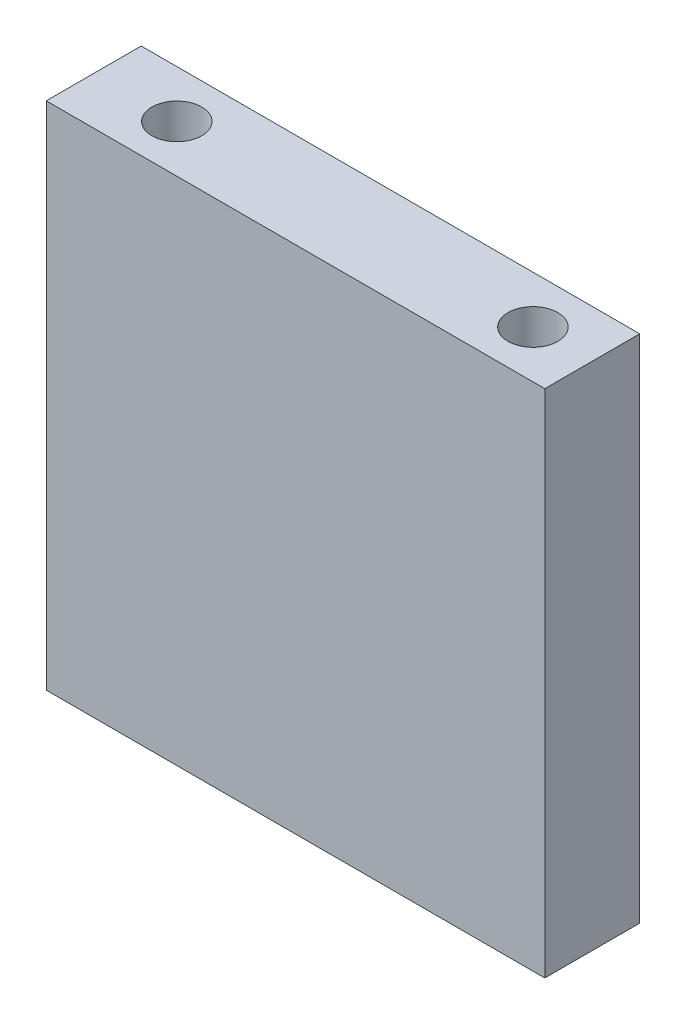
ISO-10303-21;
HEADER;
FILE_DESCRIPTION(('STEP AP214'),'2;1');
FILE_NAME('part.step','',(''),(''),'','','');
FILE_SCHEMA(('AUTOMOTIVE_DESIGN { 1 0 10303 214 1 1 1 1 }'));
ENDSEC;
DATA;
#1=APPLICATION_CONTEXT('core data for automotive mechanical design processes');
#2=APPLICATION_PROTOCOL_DEFINITION('international standard','automotive_design',2000,#1);
#3=PRODUCT_CONTEXT('',#1,'mechanical');
#4=PRODUCT('Part','Part','',(#3));
#5=PRODUCT_RELATED_PRODUCT_CATEGORY('part','',(#4));
#6=PRODUCT_DEFINITION_FORMATION('','',#4);
#7=PRODUCT_DEFINITION_CONTEXT('part definition',#1,'design');
#8=PRODUCT_DEFINITION('design','',#6,#7);
#9=PRODUCT_DEFINITION_SHAPE('','',#8);
#10=(LENGTH_UNIT() NAMED_UNIT(*) SI_UNIT(.MILLI.,.METRE.));
#11=(NAMED_UNIT(*) PLANE_ANGLE_UNIT() SI_UNIT($,.RADIAN.));
#12=(NAMED_UNIT(*) SI_UNIT($,.STERADIAN.) SOLID_ANGLE_UNIT());
#13=UNCERTAINTY_MEASURE_WITH_UNIT(LENGTH_MEASURE(1.E-05),#10,'distance_accuracy_value','');
#14=(GEOMETRIC_REPRESENTATION_CONTEXT(3) GLOBAL_UNCERTAINTY_ASSIGNED_CONTEXT((#13)) GLOBAL_UNIT_ASSIGNED_CONTEXT((#10,
#11,#12)) REPRESENTATION_CONTEXT('',''));
#15=CARTESIAN_POINT('',(0.,0.,0.));
#16=DIRECTION('',(0.,0.,1.));
#17=DIRECTION('',(1.,0.,0.));
#18=AXIS2_PLACEMENT_3D('',#15,#16,#17);
#19=CARTESIAN_POINT('',(0.,0.,8.));
#20=DIRECTION('',(1.,0.,0.));
#21=DIRECTION('',(0.,0.,-1.));
#22=AXIS2_PLACEMENT_3D('',#19,#20,#21);
#23=PLANE('',#22);
#24=DIRECTION('',(0.,-1.,0.));
#25=VECTOR('',#24,1.);
#26=CARTESIAN_POINT('',(0.,0.,0.));
#27=LINE('',#26,#25);
#28=CARTESIAN_POINT('',(0.,43.,0.));
#29=VERTEX_POINT('',#28);
#30=CARTESIAN_POINT('',(0.,0.,0.));
#31=VERTEX_POINT('',#30);
#32=EDGE_CURVE('E96',#29,#31,#27,.T.);
#33=ORIENTED_EDGE('',*,*,#32,.T.);
#34=DIRECTION('',(0.,0.,-1.));
#35=VECTOR('',#34,1.);
#36=CARTESIAN_POINT('',(0.,0.,8.));
#37=LINE('',#36,#35);
#38=CARTESIAN_POINT('',(0.,0.,8.));
#39=VERTEX_POINT('',#38);
#40=EDGE_CURVE('E11',#39,#31,#37,.T.);
#41=ORIENTED_EDGE('',*,*,#40,.F.);
#42=DIRECTION('',(0.,-1.,0.));
#43=VECTOR('',#42,1.);
#44=CARTESIAN_POINT('',(0.,0.,8.));
#45=LINE('',#44,#43);
#46=CARTESIAN_POINT('',(0.,43.,8.));
#47=VERTEX_POINT('',#46);
#48=EDGE_CURVE('E84',#47,#39,#45,.T.);
#49=ORIENTED_EDGE('',*,*,#48,.F.);
#50=DIRECTION('',(0.,0.,-1.));
#51=VECTOR('',#50,1.);
#52=CARTESIAN_POINT('',(0.,43.,8.));
#53=LINE('',#52,#51);
#54=EDGE_CURVE('E92',#47,#29,#53,.T.);
#55=ORIENTED_EDGE('',*,*,#54,.T.);
#56=EDGE_LOOP('',(#33,#41,#49,#55));
#57=FACE_BOUND('',#56,.T.);
#58=ADVANCED_FACE('F33',(#57),#23,.F.);
#59=CARTESIAN_POINT('',(0.,0.,8.));
#60=DIRECTION('',(0.,1.,0.));
#61=DIRECTION('',(0.,0.,1.));
#62=AXIS2_PLACEMENT_3D('',#59,#60,#61);
#63=PLANE('',#62);
#64=CARTESIAN_POINT('',(7.00000000000001,0.,3.99999999999979));
#65=DIRECTION('',(0.,-1.,0.));
#66=DIRECTION('',(0.,0.,-1.));
#67=AXIS2_PLACEMENT_3D('',#64,#65,#66);
#68=CIRCLE('',#67,2.1);
#69=CARTESIAN_POINT('',(7.00000000000001,0.,1.89999999999979));
#70=VERTEX_POINT('',#69);
#71=EDGE_CURVE('E117',#70,#70,#68,.T.);
#72=ORIENTED_EDGE('',*,*,#71,.F.);
#73=EDGE_LOOP('',(#72));
#74=FACE_BOUND('',#73,.T.);
#75=CARTESIAN_POINT('',(37.,0.,4.));
#76=DIRECTION('',(0.,-1.,0.));
#77=DIRECTION('',(0.,0.,-1.));
#78=AXIS2_PLACEMENT_3D('',#75,#76,#77);
#79=CIRCLE('',#78,2.1);
#80=CARTESIAN_POINT('',(37.,0.,1.9));
#81=VERTEX_POINT('',#80);
#82=EDGE_CURVE('E110',#81,#81,#79,.T.);
#83=ORIENTED_EDGE('',*,*,#82,.F.);
#84=EDGE_LOOP('',(#83));
#85=FACE_BOUND('',#84,.T.);
#86=DIRECTION('',(1.,0.,0.));
#87=VECTOR('',#86,1.);
#88=CARTESIAN_POINT('',(0.,0.,0.));
#89=LINE('',#88,#87);
#90=CARTESIAN_POINT('',(42.,0.,0.));
#91=VERTEX_POINT('',#90);
#92=EDGE_CURVE('E88',#31,#91,#89,.T.);
#93=ORIENTED_EDGE('',*,*,#92,.T.);
#94=DIRECTION('',(0.,0.,-1.));
#95=VECTOR('',#94,1.);
#96=CARTESIAN_POINT('',(42.,0.,8.));
#97=LINE('',#96,#95);
#98=CARTESIAN_POINT('',(42.,0.,8.));
#99=VERTEX_POINT('',#98);
#100=EDGE_CURVE('E41',#99,#91,#97,.T.);
#101=ORIENTED_EDGE('',*,*,#100,.F.);
#102=DIRECTION('',(1.,0.,0.));
#103=VECTOR('',#102,1.);
#104=CARTESIAN_POINT('',(0.,0.,8.));
#105=LINE('',#104,#103);
#106=EDGE_CURVE('E79',#39,#99,#105,.T.);
#107=ORIENTED_EDGE('',*,*,#106,.F.);
#108=ORIENTED_EDGE('',*,*,#40,.T.);
#109=EDGE_LOOP('',(#93,#101,#107,#108));
#110=FACE_BOUND('',#109,.T.);
#111=ADVANCED_FACE('F87',(#74,#85,#110),#63,.F.);
#112=CARTESIAN_POINT('',(42.,0.,8.));
#113=DIRECTION('',(-1.,0.,0.));
#114=DIRECTION('',(0.,0.,1.));
#115=AXIS2_PLACEMENT_3D('',#112,#113,#114);
#116=PLANE('',#115);
#117=DIRECTION('',(0.,1.,0.));
#118=VECTOR('',#117,1.);
#119=CARTESIAN_POINT('',(42.,0.,0.));
#120=LINE('',#119,#118);
#121=CARTESIAN_POINT('',(42.,43.,0.));
#122=VERTEX_POINT('',#121);
#123=EDGE_CURVE('E66',#91,#122,#120,.T.);
#124=ORIENTED_EDGE('',*,*,#123,.T.);
#125=DIRECTION('',(0.,0.,-1.));
#126=VECTOR('',#125,1.);
#127=CARTESIAN_POINT('',(42.,43.,8.));
#128=LINE('',#127,#126);
#129=CARTESIAN_POINT('',(42.,43.,8.));
#130=VERTEX_POINT('',#129);
#131=EDGE_CURVE('E89',#130,#122,#128,.T.);
#132=ORIENTED_EDGE('',*,*,#131,.F.);
#133=DIRECTION('',(0.,1.,0.));
#134=VECTOR('',#133,1.);
#135=CARTESIAN_POINT('',(42.,0.,8.));
#136=LINE('',#135,#134);
#137=EDGE_CURVE('E82',#99,#130,#136,.T.);
#138=ORIENTED_EDGE('',*,*,#137,.F.);
#139=ORIENTED_EDGE('',*,*,#100,.T.);
#140=EDGE_LOOP('',(#124,#132,#138,#139));
#141=FACE_BOUND('',#140,.T.);
#142=ADVANCED_FACE('F90',(#141),#116,.F.);
#143=CARTESIAN_POINT('',(0.,43.,8.));
#144=DIRECTION('',(0.,-1.,0.));
#145=DIRECTION('',(0.,0.,-1.));
#146=AXIS2_PLACEMENT_3D('',#143,#144,#145);
#147=PLANE('',#146);
#148=CARTESIAN_POINT('',(37.,43.,4.));
#149=DIRECTION('',(0.,1.,0.));
#150=DIRECTION('',(0.,0.,1.));
#151=AXIS2_PLACEMENT_3D('',#148,#149,#150);
#152=CIRCLE('',#151,2.1);
#153=CARTESIAN_POINT('',(37.,43.,6.1));
#154=VERTEX_POINT('',#153);
#155=EDGE_CURVE('E128',#154,#154,#152,.T.);
#156=ORIENTED_EDGE('',*,*,#155,.F.);
#157=EDGE_LOOP('',(#156));
#158=FACE_BOUND('',#157,.T.);
#159=CARTESIAN_POINT('',(7.00000000000001,43.,4.00000000000021));
#160=DIRECTION('',(0.,1.,0.));
#161=DIRECTION('',(0.,0.,1.));
#162=AXIS2_PLACEMENT_3D('',#159,#160,#161);
#163=CIRCLE('',#162,2.1);
#164=CARTESIAN_POINT('',(7.00000000000001,43.,6.10000000000021));
#165=VERTEX_POINT('',#164);
#166=EDGE_CURVE('E122',#165,#165,#163,.T.);
#167=ORIENTED_EDGE('',*,*,#166,.F.);
#168=EDGE_LOOP('',(#167));
#169=FACE_BOUND('',#168,.T.);
#170=DIRECTION('',(-1.,0.,0.));
#171=VECTOR('',#170,1.);
#172=CARTESIAN_POINT('',(0.,43.,0.));
#173=LINE('',#172,#171);
#174=EDGE_CURVE('E72',#122,#29,#173,.T.);
#175=ORIENTED_EDGE('',*,*,#174,.T.);
#176=ORIENTED_EDGE('',*,*,#54,.F.);
#177=DIRECTION('',(-1.,0.,0.));
#178=VECTOR('',#177,1.);
#179=CARTESIAN_POINT('',(0.,43.,8.));
#180=LINE('',#179,#178);
#181=EDGE_CURVE('E49',#130,#47,#180,.T.);
#182=ORIENTED_EDGE('',*,*,#181,.F.);
#183=ORIENTED_EDGE('',*,*,#131,.T.);
#184=EDGE_LOOP('',(#175,#176,#182,#183));
#185=FACE_BOUND('',#184,.T.);
#186=ADVANCED_FACE('F104',(#158,#169,#185),#147,.F.);
#187=CARTESIAN_POINT('',(0.,0.,8.));
#188=DIRECTION('',(0.,0.,-1.));
#189=DIRECTION('',(-1.,0.,0.));
#190=AXIS2_PLACEMENT_3D('',#187,#188,#189);
#191=PLANE('',#190);
#192=ORIENTED_EDGE('',*,*,#48,.T.);
#193=ORIENTED_EDGE('',*,*,#106,.T.);
#194=ORIENTED_EDGE('',*,*,#137,.T.);
#195=ORIENTED_EDGE('',*,*,#181,.T.);
#196=EDGE_LOOP('',(#192,#193,#194,#195));
#197=FACE_BOUND('',#196,.T.);
#198=ADVANCED_FACE('F80',(#197),#191,.F.);
#199=CARTESIAN_POINT('',(0.,0.,0.));
#200=DIRECTION('',(0.,0.,-1.));
#201=DIRECTION('',(-1.,0.,0.));
#202=AXIS2_PLACEMENT_3D('',#199,#200,#201);
#203=PLANE('',#202);
#204=ORIENTED_EDGE('',*,*,#32,.F.);
#205=ORIENTED_EDGE('',*,*,#174,.F.);
#206=ORIENTED_EDGE('',*,*,#123,.F.);
#207=ORIENTED_EDGE('',*,*,#92,.F.);
#208=EDGE_LOOP('',(#204,#205,#206,#207));
#209=FACE_BOUND('',#208,.T.);
#210=ADVANCED_FACE('F107',(#209),#203,.T.);
#211=CARTESIAN_POINT('',(37.,10.,4.));
#212=DIRECTION('',(0.,-1.,0.));
#213=DIRECTION('',(0.,0.,-1.));
#214=AXIS2_PLACEMENT_3D('',#211,#212,#213);
#215=CYLINDRICAL_SURFACE('',#214,2.1);
#216=CARTESIAN_POINT('',(37.,10.,4.));
#217=DIRECTION('',(0.,-1.,0.));
#218=DIRECTION('',(0.,0.,-1.));
#219=AXIS2_PLACEMENT_3D('',#216,#217,#218);
#220=CIRCLE('',#219,2.1);
#221=CARTESIAN_POINT('',(37.,10.,1.9));
#222=VERTEX_POINT('',#221);
#223=EDGE_CURVE('E113',#222,#222,#220,.T.);
#224=ORIENTED_EDGE('',*,*,#223,.F.);
#225=EDGE_LOOP('',(#224));
#226=FACE_BOUND('',#225,.T.);
#227=ORIENTED_EDGE('',*,*,#82,.T.);
#228=EDGE_LOOP('',(#227));
#229=FACE_BOUND('',#228,.T.);
#230=ADVANCED_FACE('F177',(#226,#229),#215,.F.);
#231=CARTESIAN_POINT('',(0.,10.,0.));
#232=DIRECTION('',(0.,-1.,0.));
#233=DIRECTION('',(0.,0.,-1.));
#234=AXIS2_PLACEMENT_3D('',#231,#232,#233);
#235=PLANE('',#234);
#236=ORIENTED_EDGE('',*,*,#223,.T.);
#237=EDGE_LOOP('',(#236));
#238=FACE_BOUND('',#237,.T.);
#239=ADVANCED_FACE('F182',(#238),#235,.T.);
#240=CARTESIAN_POINT('',(7.00000000000001,10.,3.99999999999979));
#241=DIRECTION('',(0.,-1.,0.));
#242=DIRECTION('',(0.,0.,-1.));
#243=AXIS2_PLACEMENT_3D('',#240,#241,#242);
#244=CYLINDRICAL_SURFACE('',#243,2.1);
#245=CARTESIAN_POINT('',(7.00000000000001,10.,3.99999999999979));
#246=DIRECTION('',(0.,-1.,0.));
#247=DIRECTION('',(0.,0.,-1.));
#248=AXIS2_PLACEMENT_3D('',#245,#246,#247);
#249=CIRCLE('',#248,2.1);
#250=CARTESIAN_POINT('',(7.00000000000001,10.,1.89999999999979));
#251=VERTEX_POINT('',#250);
#252=EDGE_CURVE('E99',#251,#251,#249,.T.);
#253=ORIENTED_EDGE('',*,*,#252,.F.);
#254=EDGE_LOOP('',(#253));
#255=FACE_BOUND('',#254,.T.);
#256=ORIENTED_EDGE('',*,*,#71,.T.);
#257=EDGE_LOOP('',(#256));
#258=FACE_BOUND('',#257,.T.);
#259=ADVANCED_FACE('F159',(#255,#258),#244,.F.);
#260=CARTESIAN_POINT('',(0.,10.,0.));
#261=DIRECTION('',(0.,-1.,0.));
#262=DIRECTION('',(0.,0.,-1.));
#263=AXIS2_PLACEMENT_3D('',#260,#261,#262);
#264=PLANE('',#263);
#265=ORIENTED_EDGE('',*,*,#252,.T.);
#266=EDGE_LOOP('',(#265));
#267=FACE_BOUND('',#266,.T.);
#268=ADVANCED_FACE('F150',(#267),#264,.T.);
#269=CARTESIAN_POINT('',(7.00000000000001,33.,4.00000000000021));
#270=DIRECTION('',(0.,1.,0.));
#271=DIRECTION('',(0.,0.,1.));
#272=AXIS2_PLACEMENT_3D('',#269,#270,#271);
#273=CYLINDRICAL_SURFACE('',#272,2.1);
#274=CARTESIAN_POINT('',(7.00000000000001,33.,4.00000000000021));
#275=DIRECTION('',(0.,1.,0.));
#276=DIRECTION('',(0.,0.,1.));
#277=AXIS2_PLACEMENT_3D('',#274,#275,#276);
#278=CIRCLE('',#277,2.1);
#279=CARTESIAN_POINT('',(7.00000000000001,33.,6.10000000000021));
#280=VERTEX_POINT('',#279);
#281=EDGE_CURVE('E125',#280,#280,#278,.T.);
#282=ORIENTED_EDGE('',*,*,#281,.F.);
#283=EDGE_LOOP('',(#282));
#284=FACE_BOUND('',#283,.T.);
#285=ORIENTED_EDGE('',*,*,#166,.T.);
#286=EDGE_LOOP('',(#285));
#287=FACE_BOUND('',#286,.T.);
#288=ADVANCED_FACE('F148',(#284,#287),#273,.F.);
#289=CARTESIAN_POINT('',(7.00000000000001,33.,4.00000000000021));
#290=DIRECTION('',(0.,1.,0.));
#291=DIRECTION('',(0.,0.,1.));
#292=AXIS2_PLACEMENT_3D('',#289,#290,#291);
#293=PLANE('',#292);
#294=ORIENTED_EDGE('',*,*,#281,.T.);
#295=EDGE_LOOP('',(#294));
#296=FACE_BOUND('',#295,.T.);
#297=ADVANCED_FACE('F139',(#296),#293,.T.);
#298=CARTESIAN_POINT('',(37.,33.,4.));
#299=DIRECTION('',(0.,1.,0.));
#300=DIRECTION('',(0.,0.,1.));
#301=AXIS2_PLACEMENT_3D('',#298,#299,#300);
#302=CYLINDRICAL_SURFACE('',#301,2.1);
#303=CARTESIAN_POINT('',(37.,33.,4.));
#304=DIRECTION('',(0.,1.,0.));
#305=DIRECTION('',(0.,0.,1.));
#306=AXIS2_PLACEMENT_3D('',#303,#304,#305);
#307=CIRCLE('',#306,2.1);
#308=CARTESIAN_POINT('',(37.,33.,6.1));
#309=VERTEX_POINT('',#308);
#310=EDGE_CURVE('E114',#309,#309,#307,.T.);
#311=ORIENTED_EDGE('',*,*,#310,.F.);
#312=EDGE_LOOP('',(#311));
#313=FACE_BOUND('',#312,.T.);
#314=ORIENTED_EDGE('',*,*,#155,.T.);
#315=EDGE_LOOP('',(#314));
#316=FACE_BOUND('',#315,.T.);
#317=ADVANCED_FACE('F136',(#313,#316),#302,.F.);
#318=CARTESIAN_POINT('',(37.,33.,4.));
#319=DIRECTION('',(0.,1.,0.));
#320=DIRECTION('',(0.,0.,1.));
#321=AXIS2_PLACEMENT_3D('',#318,#319,#320);
#322=PLANE('',#321);
#323=ORIENTED_EDGE('',*,*,#310,.T.);
#324=EDGE_LOOP('',(#323));
#325=FACE_BOUND('',#324,.T.);
#326=ADVANCED_FACE('F134',(#325),#322,.T.);
#327=CLOSED_SHELL('',(#58,#111,#142,#186,#198,#210,#230,#239,#259,#268,#288,#297,#317,#326));
#328=MANIFOLD_SOLID_BREP('B2',#327);
#329=ADVANCED_BREP_SHAPE_REPRESENTATION('',(#18,#328),#14);
#330=SHAPE_DEFINITION_REPRESENTATION(#9,#329);
ENDSEC;
END-ISO-10303-21;
